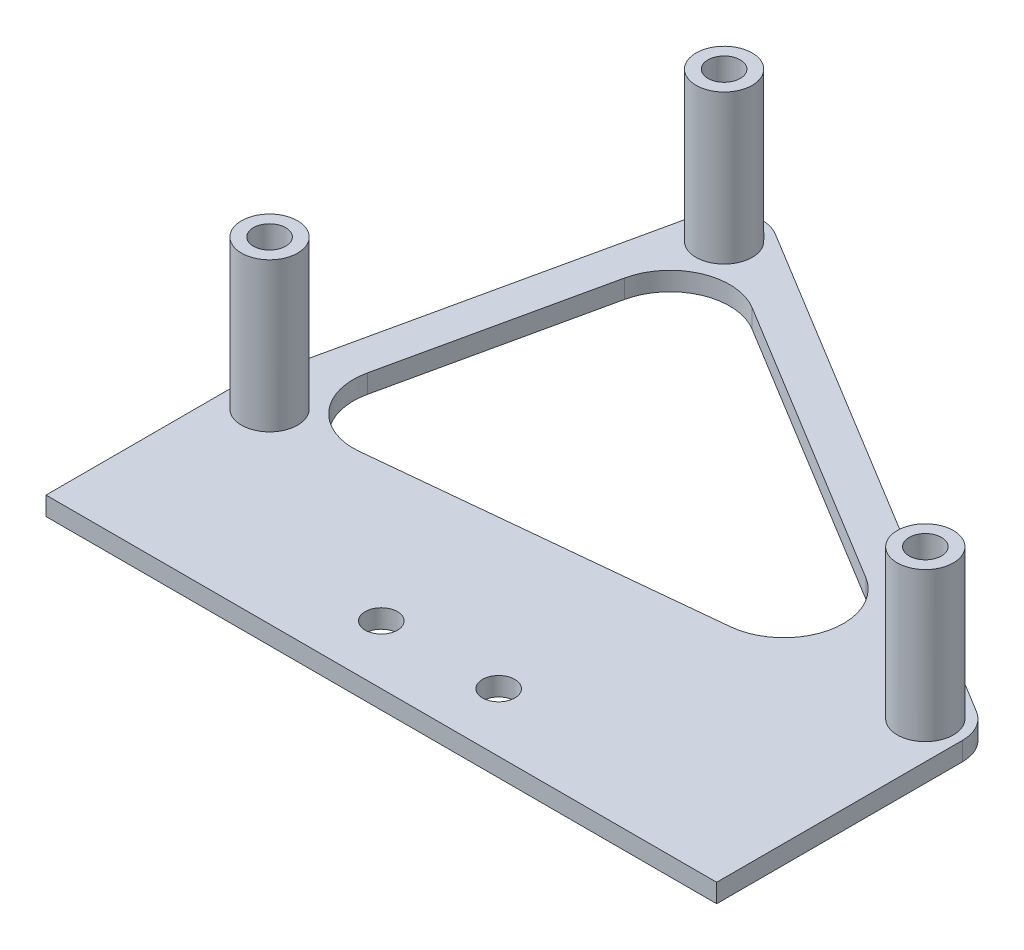
ISO-10303-21;
HEADER;
FILE_DESCRIPTION(('STEP AP214'),'2;1');
FILE_NAME('part.step','',(''),(''),'','','');
FILE_SCHEMA(('AUTOMOTIVE_DESIGN { 1 0 10303 214 1 1 1 1 }'));
ENDSEC;
DATA;
#1=APPLICATION_CONTEXT('core data for automotive mechanical design processes');
#2=APPLICATION_PROTOCOL_DEFINITION('international standard','automotive_design',2000,#1);
#3=PRODUCT_CONTEXT('',#1,'mechanical');
#4=PRODUCT('Part','Part','',(#3));
#5=PRODUCT_RELATED_PRODUCT_CATEGORY('part','',(#4));
#6=PRODUCT_DEFINITION_FORMATION('','',#4);
#7=PRODUCT_DEFINITION_CONTEXT('part definition',#1,'design');
#8=PRODUCT_DEFINITION('design','',#6,#7);
#9=PRODUCT_DEFINITION_SHAPE('','',#8);
#10=(LENGTH_UNIT() NAMED_UNIT(*) SI_UNIT(.MILLI.,.METRE.));
#11=(NAMED_UNIT(*) PLANE_ANGLE_UNIT() SI_UNIT($,.RADIAN.));
#12=(NAMED_UNIT(*) SI_UNIT($,.STERADIAN.) SOLID_ANGLE_UNIT());
#13=UNCERTAINTY_MEASURE_WITH_UNIT(LENGTH_MEASURE(1.E-05),#10,'distance_accuracy_value','');
#14=(GEOMETRIC_REPRESENTATION_CONTEXT(3) GLOBAL_UNCERTAINTY_ASSIGNED_CONTEXT((#13)) GLOBAL_UNIT_ASSIGNED_CONTEXT((#10,
#11,#12)) REPRESENTATION_CONTEXT('',''));
#15=CARTESIAN_POINT('',(0.,0.,0.));
#16=DIRECTION('',(0.,0.,1.));
#17=DIRECTION('',(1.,0.,0.));
#18=AXIS2_PLACEMENT_3D('',#15,#16,#17);
#19=CARTESIAN_POINT('',(-40.3225,0.,-42.545));
#20=DIRECTION('',(0.,-1.,0.));
#21=DIRECTION('',(0.,0.,-1.));
#22=AXIS2_PLACEMENT_3D('',#19,#20,#21);
#23=PLANE('',#22);
#24=CARTESIAN_POINT('',(-13.492499939,0.,42.705));
#25=DIRECTION('',(0.,1.,0.));
#26=DIRECTION('',(0.,0.,1.));
#27=AXIS2_PLACEMENT_3D('',#24,#25,#26);
#28=CIRCLE('',#27,2.749999961);
#29=CARTESIAN_POINT('',(-13.492499939,0.,45.454999961));
#30=VERTEX_POINT('',#29);
#31=EDGE_CURVE('E488',#30,#30,#28,.T.);
#32=ORIENTED_EDGE('',*,*,#31,.F.);
#33=EDGE_LOOP('',(#32));
#34=FACE_BOUND('',#33,.T.);
#35=CARTESIAN_POINT('',(6.50749993900001,0.,42.705));
#36=DIRECTION('',(0.,1.,0.));
#37=DIRECTION('',(0.,0.,1.));
#38=AXIS2_PLACEMENT_3D('',#35,#36,#37);
#39=CIRCLE('',#38,2.749999961);
#40=CARTESIAN_POINT('',(6.50749993900001,0.,45.454999961));
#41=VERTEX_POINT('',#40);
#42=EDGE_CURVE('E494',#41,#41,#39,.T.);
#43=ORIENTED_EDGE('',*,*,#42,.F.);
#44=EDGE_LOOP('',(#43));
#45=FACE_BOUND('',#44,.T.);
#46=CARTESIAN_POINT('',(-54.2925,0.,20.955));
#47=DIRECTION('',(0.,-1.,0.));
#48=DIRECTION('',(0.,0.,-1.));
#49=AXIS2_PLACEMENT_3D('',#46,#47,#48);
#50=CIRCLE('',#49,4.78199999999999);
#51=CARTESIAN_POINT('',(-54.2925,0.,16.173));
#52=VERTEX_POINT('',#51);
#53=EDGE_CURVE('E60',#52,#52,#50,.F.);
#54=ORIENTED_EDGE('',*,*,#53,.F.);
#55=EDGE_LOOP('',(#54));
#56=FACE_BOUND('',#55,.T.);
#57=DIRECTION('',(-0.854198555614438,0.,-0.519946946895745));
#58=VECTOR('',#57,1.);
#59=CARTESIAN_POINT('',(-40.3225,0.,-42.545));
#60=LINE('',#59,#58);
#61=CARTESIAN_POINT('',(21.399248973296,0.,-4.97523975538504));
#62=VERTEX_POINT('',#61);
#63=CARTESIAN_POINT('',(-28.1731352082768,0.,-35.1497344746033));
#64=VERTEX_POINT('',#63);
#65=EDGE_CURVE('E189',#62,#64,#60,.T.);
#66=ORIENTED_EDGE('',*,*,#65,.F.);
#67=CARTESIAN_POINT('',(16.1165879928353,0.,3.70341756965765));
#68=DIRECTION('',(0.,-1.,0.));
#69=DIRECTION('',(0.,0.,-1.));
#70=AXIS2_PLACEMENT_3D('',#67,#68,#69);
#71=CIRCLE('',#70,10.16);
#72=CARTESIAN_POINT('',(17.1275457780886,0.,13.8129954221911));
#73=VERTEX_POINT('',#72);
#74=EDGE_CURVE('E255',#62,#73,#71,.T.);
#75=ORIENTED_EDGE('',*,*,#74,.T.);
#76=DIRECTION('',(0.995037190209989,0.,-0.0995037190209989));
#77=VECTOR('',#76,1.);
#78=CARTESIAN_POINT('',(47.3075,0.,10.795));
#79=LINE('',#78,#77);
#80=CARTESIAN_POINT('',(-40.3476822585176,0.,19.5605182258518));
#81=VERTEX_POINT('',#80);
#82=EDGE_CURVE('E193',#81,#73,#79,.T.);
#83=ORIENTED_EDGE('',*,*,#82,.F.);
#84=CARTESIAN_POINT('',(-41.3586400437709,0.,9.45094037331826));
#85=DIRECTION('',(0.,-1.,0.));
#86=DIRECTION('',(0.,0.,-1.));
#87=AXIS2_PLACEMENT_3D('',#84,#85,#86);
#88=CIRCLE('',#87,10.16);
#89=CARTESIAN_POINT('',(-51.2813478254946,0.,7.26794466133905));
#90=VERTEX_POINT('',#89);
#91=EDGE_CURVE('E259',#81,#90,#88,.T.);
#92=ORIENTED_EDGE('',*,*,#91,.T.);
#93=DIRECTION('',(-0.21486178267512,0.,0.97664446670509));
#94=VECTOR('',#93,1.);
#95=CARTESIAN_POINT('',(-54.2925,0.,20.955));
#96=LINE('',#95,#94);
#97=CARTESIAN_POINT('',(-43.3785039704613,0.,-28.6540728615398));
#98=VERTEX_POINT('',#97);
#99=EDGE_CURVE('E188',#98,#90,#96,.T.);
#100=ORIENTED_EDGE('',*,*,#99,.F.);
#101=CARTESIAN_POINT('',(-33.4557961887375,0.,-26.4710771495606));
#102=DIRECTION('',(0.,-1.,0.));
#103=DIRECTION('',(0.,0.,-1.));
#104=AXIS2_PLACEMENT_3D('',#101,#102,#103);
#105=CIRCLE('',#104,10.16);
#106=EDGE_CURVE('E263',#98,#64,#105,.T.);
#107=ORIENTED_EDGE('',*,*,#106,.T.);
#108=EDGE_LOOP('',(#66,#75,#83,#92,#100,#107));
#109=FACE_BOUND('',#108,.T.);
#110=DIRECTION('',(0.,0.,-1.));
#111=VECTOR('',#110,1.);
#112=CARTESIAN_POINT('',(53.6575,0.,52.705));
#113=LINE('',#112,#111);
#114=CARTESIAN_POINT('',(53.6575,0.,52.705));
#115=VERTEX_POINT('',#114);
#116=CARTESIAN_POINT('',(53.6575,0.,10.795));
#117=VERTEX_POINT('',#116);
#118=EDGE_CURVE('E176',#115,#117,#113,.T.);
#119=ORIENTED_EDGE('',*,*,#118,.T.);
#120=CARTESIAN_POINT('',(47.3075,0.,10.795));
#121=DIRECTION('',(0.,1.,0.));
#122=DIRECTION('',(0.,0.,-1.));
#123=AXIS2_PLACEMENT_3D('',#120,#121,#122);
#124=CIRCLE('',#123,6.35);
#125=CARTESIAN_POINT('',(50.609163112788,0.,5.3708391718483));
#126=VERTEX_POINT('',#125);
#127=EDGE_CURVE('E72',#117,#126,#124,.T.);
#128=ORIENTED_EDGE('',*,*,#127,.T.);
#129=DIRECTION('',(-0.854198555614438,0.,-0.519946946895745));
#130=VECTOR('',#129,1.);
#131=CARTESIAN_POINT('',(-37.020836887212,0.,-47.9691608281517));
#132=LINE('',#131,#130);
#133=CARTESIAN_POINT('',(-37.020836887212,0.,-47.9691608281517));
#134=VERTEX_POINT('',#133);
#135=EDGE_CURVE('E211',#126,#134,#132,.T.);
#136=ORIENTED_EDGE('',*,*,#135,.T.);
#137=CARTESIAN_POINT('',(-40.3225,0.,-42.545));
#138=DIRECTION('',(0.,1.,0.));
#139=DIRECTION('',(0.,0.,-1.));
#140=AXIS2_PLACEMENT_3D('',#137,#138,#139);
#141=CIRCLE('',#140,6.35000000000001);
#142=CARTESIAN_POINT('',(-46.5241923635773,0.,-43.909372319987));
#143=VERTEX_POINT('',#142);
#144=EDGE_CURVE('E201',#134,#143,#141,.T.);
#145=ORIENTED_EDGE('',*,*,#144,.T.);
#146=DIRECTION('',(-0.21486178267512,0.,0.97664446670509));
#147=VECTOR('',#146,1.);
#148=CARTESIAN_POINT('',(-60.4941923635773,0.,19.590627680013));
#149=LINE('',#148,#147);
#150=CARTESIAN_POINT('',(-60.4941923635773,0.,19.590627680013));
#151=VERTEX_POINT('',#150);
#152=EDGE_CURVE('E224',#143,#151,#149,.T.);
#153=ORIENTED_EDGE('',*,*,#152,.T.);
#154=CARTESIAN_POINT('',(-54.2925,0.,20.955));
#155=DIRECTION('',(0.,1.,0.));
#156=DIRECTION('',(0.,0.,-1.));
#157=AXIS2_PLACEMENT_3D('',#154,#155,#156);
#158=CIRCLE('',#157,6.35);
#159=CARTESIAN_POINT('',(-60.6425,0.,20.955));
#160=VERTEX_POINT('',#159);
#161=EDGE_CURVE('E227',#151,#160,#158,.T.);
#162=ORIENTED_EDGE('',*,*,#161,.T.);
#163=DIRECTION('',(0.,0.,1.));
#164=VECTOR('',#163,1.);
#165=CARTESIAN_POINT('',(-60.6425,0.,20.955));
#166=LINE('',#165,#164);
#167=CARTESIAN_POINT('',(-60.6425,0.,52.705));
#168=VERTEX_POINT('',#167);
#169=EDGE_CURVE('E182',#160,#168,#166,.T.);
#170=ORIENTED_EDGE('',*,*,#169,.T.);
#171=DIRECTION('',(1.,0.,0.));
#172=VECTOR('',#171,1.);
#173=CARTESIAN_POINT('',(-60.6425,0.,52.705));
#174=LINE('',#173,#172);
#175=EDGE_CURVE('E169',#168,#115,#174,.T.);
#176=ORIENTED_EDGE('',*,*,#175,.T.);
#177=EDGE_LOOP('',(#119,#128,#136,#145,#153,#162,#170,#176));
#178=FACE_BOUND('',#177,.T.);
#179=CARTESIAN_POINT('',(47.3075,0.,10.795));
#180=DIRECTION('',(0.,-1.,0.));
#181=DIRECTION('',(0.,0.,-1.));
#182=AXIS2_PLACEMENT_3D('',#179,#180,#181);
#183=CIRCLE('',#182,4.78200000000001);
#184=CARTESIAN_POINT('',(47.3075,0.,6.01299999999998));
#185=VERTEX_POINT('',#184);
#186=EDGE_CURVE('E267',#185,#185,#183,.F.);
#187=ORIENTED_EDGE('',*,*,#186,.F.);
#188=EDGE_LOOP('',(#187));
#189=FACE_BOUND('',#188,.T.);
#190=CARTESIAN_POINT('',(-40.3225,0.,-42.545));
#191=DIRECTION('',(0.,-1.,0.));
#192=DIRECTION('',(0.,0.,-1.));
#193=AXIS2_PLACEMENT_3D('',#190,#191,#192);
#194=CIRCLE('',#193,4.782);
#195=CARTESIAN_POINT('',(-40.3225,0.,-47.327));
#196=VERTEX_POINT('',#195);
#197=EDGE_CURVE('E12',#196,#196,#194,.F.);
#198=ORIENTED_EDGE('',*,*,#197,.F.);
#199=EDGE_LOOP('',(#198));
#200=FACE_BOUND('',#199,.T.);
#201=ADVANCED_FACE('F52',(#34,#45,#56,#109,#178,#189,#200),#23,.F.);
#202=CARTESIAN_POINT('',(47.3075,-3.175,10.795));
#203=DIRECTION('',(0.,1.,0.));
#204=DIRECTION('',(0.,0.,1.));
#205=AXIS2_PLACEMENT_3D('',#202,#203,#204);
#206=CYLINDRICAL_SURFACE('',#205,6.35);
#207=ORIENTED_EDGE('',*,*,#127,.F.);
#208=DIRECTION('',(0.,1.,0.));
#209=VECTOR('',#208,1.);
#210=CARTESIAN_POINT('',(53.6575,-124.916275252069,10.795));
#211=LINE('',#210,#209);
#212=CARTESIAN_POINT('',(53.6575,-3.175,10.795));
#213=VERTEX_POINT('',#212);
#214=EDGE_CURVE('E67',#213,#117,#211,.T.);
#215=ORIENTED_EDGE('',*,*,#214,.F.);
#216=CARTESIAN_POINT('',(47.3075,-3.175,10.795));
#217=DIRECTION('',(0.,1.,0.));
#218=DIRECTION('',(0.,0.,-1.));
#219=AXIS2_PLACEMENT_3D('',#216,#217,#218);
#220=CIRCLE('',#219,6.35);
#221=CARTESIAN_POINT('',(50.609163112788,-3.175,5.3708391718483));
#222=VERTEX_POINT('',#221);
#223=EDGE_CURVE('E216',#213,#222,#220,.T.);
#224=ORIENTED_EDGE('',*,*,#223,.T.);
#225=DIRECTION('',(0.,1.,0.));
#226=VECTOR('',#225,1.);
#227=CARTESIAN_POINT('',(50.609163112788,-3.175,5.3708391718483));
#228=LINE('',#227,#226);
#229=EDGE_CURVE('E236',#222,#126,#228,.T.);
#230=ORIENTED_EDGE('',*,*,#229,.T.);
#231=EDGE_LOOP('',(#207,#215,#224,#230));
#232=FACE_BOUND('',#231,.T.);
#233=ADVANCED_FACE('F276',(#232),#206,.T.);
#234=CARTESIAN_POINT('',(-40.3225,-3.175,-42.545));
#235=DIRECTION('',(0.,-1.,0.));
#236=DIRECTION('',(0.,0.,-1.));
#237=AXIS2_PLACEMENT_3D('',#234,#235,#236);
#238=PLANE('',#237);
#239=CARTESIAN_POINT('',(-13.492499939,-3.175,42.705));
#240=DIRECTION('',(0.,1.,0.));
#241=DIRECTION('',(0.,0.,1.));
#242=AXIS2_PLACEMENT_3D('',#239,#240,#241);
#243=CIRCLE('',#242,2.749999961);
#244=CARTESIAN_POINT('',(-13.492499939,-3.175,45.454999961));
#245=VERTEX_POINT('',#244);
#246=EDGE_CURVE('E485',#245,#245,#243,.T.);
#247=ORIENTED_EDGE('',*,*,#246,.T.);
#248=EDGE_LOOP('',(#247));
#249=FACE_BOUND('',#248,.T.);
#250=CARTESIAN_POINT('',(6.50749993900001,-3.175,42.705));
#251=DIRECTION('',(0.,1.,0.));
#252=DIRECTION('',(0.,0.,1.));
#253=AXIS2_PLACEMENT_3D('',#250,#251,#252);
#254=CIRCLE('',#253,2.749999961);
#255=CARTESIAN_POINT('',(6.50749993900001,-3.175,45.454999961));
#256=VERTEX_POINT('',#255);
#257=EDGE_CURVE('E489',#256,#256,#254,.T.);
#258=ORIENTED_EDGE('',*,*,#257,.T.);
#259=EDGE_LOOP('',(#258));
#260=FACE_BOUND('',#259,.T.);
#261=CARTESIAN_POINT('',(-54.2925,-3.175,20.955));
#262=DIRECTION('',(0.,1.,0.));
#263=DIRECTION('',(0.,0.,1.));
#264=AXIS2_PLACEMENT_3D('',#261,#262,#263);
#265=CIRCLE('',#264,2.74999999999999);
#266=CARTESIAN_POINT('',(-54.2925,-3.175,23.705));
#267=VERTEX_POINT('',#266);
#268=EDGE_CURVE('E517',#267,#267,#265,.T.);
#269=ORIENTED_EDGE('',*,*,#268,.T.);
#270=EDGE_LOOP('',(#269));
#271=FACE_BOUND('',#270,.T.);
#272=CARTESIAN_POINT('',(47.3075,-3.175,10.795));
#273=DIRECTION('',(0.,1.,0.));
#274=DIRECTION('',(0.,0.,1.));
#275=AXIS2_PLACEMENT_3D('',#272,#273,#274);
#276=CIRCLE('',#275,2.75000000000001);
#277=CARTESIAN_POINT('',(47.3075,-3.175,13.545));
#278=VERTEX_POINT('',#277);
#279=EDGE_CURVE('E520',#278,#278,#276,.T.);
#280=ORIENTED_EDGE('',*,*,#279,.T.);
#281=EDGE_LOOP('',(#280));
#282=FACE_BOUND('',#281,.T.);
#283=CARTESIAN_POINT('',(-40.3225,-3.175,-42.545));
#284=DIRECTION('',(0.,1.,0.));
#285=DIRECTION('',(0.,0.,1.));
#286=AXIS2_PLACEMENT_3D('',#283,#284,#285);
#287=CIRCLE('',#286,2.75);
#288=CARTESIAN_POINT('',(-40.3225,-3.175,-39.795));
#289=VERTEX_POINT('',#288);
#290=EDGE_CURVE('E516',#289,#289,#287,.T.);
#291=ORIENTED_EDGE('',*,*,#290,.T.);
#292=EDGE_LOOP('',(#291));
#293=FACE_BOUND('',#292,.T.);
#294=ORIENTED_EDGE('',*,*,#223,.F.);
#295=DIRECTION('',(0.,0.,-1.));
#296=VECTOR('',#295,1.);
#297=CARTESIAN_POINT('',(53.6575,-3.175,52.705));
#298=LINE('',#297,#296);
#299=CARTESIAN_POINT('',(53.6575,-3.175,52.705));
#300=VERTEX_POINT('',#299);
#301=EDGE_CURVE('E160',#300,#213,#298,.T.);
#302=ORIENTED_EDGE('',*,*,#301,.F.);
#303=DIRECTION('',(1.,0.,0.));
#304=VECTOR('',#303,1.);
#305=CARTESIAN_POINT('',(-60.6425,-3.175,52.705));
#306=LINE('',#305,#304);
#307=CARTESIAN_POINT('',(-60.6425,-3.175,52.705));
#308=VERTEX_POINT('',#307);
#309=EDGE_CURVE('E151',#308,#300,#306,.T.);
#310=ORIENTED_EDGE('',*,*,#309,.F.);
#311=DIRECTION('',(0.,0.,1.));
#312=VECTOR('',#311,1.);
#313=CARTESIAN_POINT('',(-60.6425,-3.175,20.955));
#314=LINE('',#313,#312);
#315=CARTESIAN_POINT('',(-60.6425,-3.175,20.955));
#316=VERTEX_POINT('',#315);
#317=EDGE_CURVE('E157',#316,#308,#314,.T.);
#318=ORIENTED_EDGE('',*,*,#317,.F.);
#319=CARTESIAN_POINT('',(-54.2925,-3.175,20.955));
#320=DIRECTION('',(0.,1.,0.));
#321=DIRECTION('',(0.,0.,-1.));
#322=AXIS2_PLACEMENT_3D('',#319,#320,#321);
#323=CIRCLE('',#322,6.35);
#324=CARTESIAN_POINT('',(-60.4941923635773,-3.175,19.590627680013));
#325=VERTEX_POINT('',#324);
#326=EDGE_CURVE('E214',#325,#316,#323,.T.);
#327=ORIENTED_EDGE('',*,*,#326,.F.);
#328=DIRECTION('',(-0.21486178267512,0.,0.97664446670509));
#329=VECTOR('',#328,1.);
#330=CARTESIAN_POINT('',(-60.4941923635773,-3.175,19.590627680013));
#331=LINE('',#330,#329);
#332=CARTESIAN_POINT('',(-46.5241923635773,-3.175,-43.909372319987));
#333=VERTEX_POINT('',#332);
#334=EDGE_CURVE('E210',#333,#325,#331,.T.);
#335=ORIENTED_EDGE('',*,*,#334,.F.);
#336=CARTESIAN_POINT('',(-40.3225,-3.175,-42.545));
#337=DIRECTION('',(0.,1.,0.));
#338=DIRECTION('',(0.,0.,-1.));
#339=AXIS2_PLACEMENT_3D('',#336,#337,#338);
#340=CIRCLE('',#339,6.35000000000001);
#341=CARTESIAN_POINT('',(-37.020836887212,-3.175,-47.9691608281517));
#342=VERTEX_POINT('',#341);
#343=EDGE_CURVE('E207',#342,#333,#340,.T.);
#344=ORIENTED_EDGE('',*,*,#343,.F.);
#345=DIRECTION('',(-0.854198555614438,0.,-0.519946946895745));
#346=VECTOR('',#345,1.);
#347=CARTESIAN_POINT('',(-37.020836887212,-3.175,-47.9691608281517));
#348=LINE('',#347,#346);
#349=EDGE_CURVE('E218',#222,#342,#348,.T.);
#350=ORIENTED_EDGE('',*,*,#349,.F.);
#351=EDGE_LOOP('',(#294,#302,#310,#318,#327,#335,#344,#350));
#352=FACE_BOUND('',#351,.T.);
#353=DIRECTION('',(0.995037190209989,0.,-0.0995037190209989));
#354=VECTOR('',#353,1.);
#355=CARTESIAN_POINT('',(47.3075,-3.175,10.795));
#356=LINE('',#355,#354);
#357=CARTESIAN_POINT('',(-40.3476822585176,-3.175,19.5605182258518));
#358=VERTEX_POINT('',#357);
#359=CARTESIAN_POINT('',(17.1275457780886,-3.175,13.8129954221911));
#360=VERTEX_POINT('',#359);
#361=EDGE_CURVE('E202',#358,#360,#356,.T.);
#362=ORIENTED_EDGE('',*,*,#361,.T.);
#363=CARTESIAN_POINT('',(16.1165879928353,-3.175,3.70341756965765));
#364=DIRECTION('',(0.,-1.,0.));
#365=DIRECTION('',(0.,0.,-1.));
#366=AXIS2_PLACEMENT_3D('',#363,#364,#365);
#367=CIRCLE('',#366,10.16);
#368=CARTESIAN_POINT('',(21.399248973296,-3.175,-4.97523975538504));
#369=VERTEX_POINT('',#368);
#370=EDGE_CURVE('E257',#360,#369,#367,.F.);
#371=ORIENTED_EDGE('',*,*,#370,.T.);
#372=DIRECTION('',(-0.854198555614438,0.,-0.519946946895745));
#373=VECTOR('',#372,1.);
#374=CARTESIAN_POINT('',(-40.3225,-3.175,-42.545));
#375=LINE('',#374,#373);
#376=CARTESIAN_POINT('',(-28.1731352082768,-3.175,-35.1497344746033));
#377=VERTEX_POINT('',#376);
#378=EDGE_CURVE('E198',#369,#377,#375,.T.);
#379=ORIENTED_EDGE('',*,*,#378,.T.);
#380=CARTESIAN_POINT('',(-33.4557961887375,-3.175,-26.4710771495606));
#381=DIRECTION('',(0.,-1.,0.));
#382=DIRECTION('',(0.,0.,-1.));
#383=AXIS2_PLACEMENT_3D('',#380,#381,#382);
#384=CIRCLE('',#383,10.16);
#385=CARTESIAN_POINT('',(-43.3785039704613,-3.175,-28.6540728615398));
#386=VERTEX_POINT('',#385);
#387=EDGE_CURVE('E265',#377,#386,#384,.F.);
#388=ORIENTED_EDGE('',*,*,#387,.T.);
#389=DIRECTION('',(-0.21486178267512,0.,0.97664446670509));
#390=VECTOR('',#389,1.);
#391=CARTESIAN_POINT('',(-54.2925,-3.175,20.955));
#392=LINE('',#391,#390);
#393=CARTESIAN_POINT('',(-51.2813478254946,-3.175,7.26794466133905));
#394=VERTEX_POINT('',#393);
#395=EDGE_CURVE('E192',#386,#394,#392,.T.);
#396=ORIENTED_EDGE('',*,*,#395,.T.);
#397=CARTESIAN_POINT('',(-41.3586400437709,-3.175,9.45094037331826));
#398=DIRECTION('',(0.,-1.,0.));
#399=DIRECTION('',(0.,0.,-1.));
#400=AXIS2_PLACEMENT_3D('',#397,#398,#399);
#401=CIRCLE('',#400,10.16);
#402=EDGE_CURVE('E261',#394,#358,#401,.F.);
#403=ORIENTED_EDGE('',*,*,#402,.T.);
#404=EDGE_LOOP('',(#362,#371,#379,#388,#396,#403));
#405=FACE_BOUND('',#404,.T.);
#406=ADVANCED_FACE('F153',(#249,#260,#271,#282,#293,#352,#405),#238,.T.);
#407=CARTESIAN_POINT('',(-40.3225,-3.175,-42.545));
#408=DIRECTION('',(0.,1.,0.));
#409=DIRECTION('',(0.,0.,1.));
#410=AXIS2_PLACEMENT_3D('',#407,#408,#409);
#411=CYLINDRICAL_SURFACE('',#410,6.35000000000001);
#412=ORIENTED_EDGE('',*,*,#144,.F.);
#413=DIRECTION('',(0.,1.,0.));
#414=VECTOR('',#413,1.);
#415=CARTESIAN_POINT('',(-37.020836887212,-3.175,-47.9691608281517));
#416=LINE('',#415,#414);
#417=EDGE_CURVE('E233',#342,#134,#416,.T.);
#418=ORIENTED_EDGE('',*,*,#417,.F.);
#419=ORIENTED_EDGE('',*,*,#343,.T.);
#420=DIRECTION('',(0.,1.,0.));
#421=VECTOR('',#420,1.);
#422=CARTESIAN_POINT('',(-46.5241923635773,-3.175,-43.909372319987));
#423=LINE('',#422,#421);
#424=EDGE_CURVE('E221',#333,#143,#423,.T.);
#425=ORIENTED_EDGE('',*,*,#424,.T.);
#426=EDGE_LOOP('',(#412,#418,#419,#425));
#427=FACE_BOUND('',#426,.T.);
#428=ADVANCED_FACE('F354',(#427),#411,.T.);
#429=CARTESIAN_POINT('',(-37.020836887212,-3.175,-47.9691608281517));
#430=DIRECTION('',(0.519946946895745,0.,-0.854198555614438));
#431=DIRECTION('',(-0.854198555614438,0.,-0.519946946895745));
#432=AXIS2_PLACEMENT_3D('',#429,#430,#431);
#433=PLANE('',#432);
#434=ORIENTED_EDGE('',*,*,#135,.F.);
#435=ORIENTED_EDGE('',*,*,#229,.F.);
#436=ORIENTED_EDGE('',*,*,#349,.T.);
#437=ORIENTED_EDGE('',*,*,#417,.T.);
#438=EDGE_LOOP('',(#434,#435,#436,#437));
#439=FACE_BOUND('',#438,.T.);
#440=ADVANCED_FACE('F357',(#439),#433,.T.);
#441=CARTESIAN_POINT('',(-54.2925,-3.175,20.955));
#442=DIRECTION('',(0.,1.,0.));
#443=DIRECTION('',(0.,0.,1.));
#444=AXIS2_PLACEMENT_3D('',#441,#442,#443);
#445=CYLINDRICAL_SURFACE('',#444,6.35);
#446=DIRECTION('',(0.,1.,0.));
#447=VECTOR('',#446,1.);
#448=CARTESIAN_POINT('',(-60.6425,-124.916275252069,20.955));
#449=LINE('',#448,#447);
#450=EDGE_CURVE('E175',#316,#160,#449,.T.);
#451=ORIENTED_EDGE('',*,*,#450,.T.);
#452=ORIENTED_EDGE('',*,*,#161,.F.);
#453=DIRECTION('',(0.,1.,0.));
#454=VECTOR('',#453,1.);
#455=CARTESIAN_POINT('',(-60.4941923635773,-3.175,19.590627680013));
#456=LINE('',#455,#454);
#457=EDGE_CURVE('E238',#325,#151,#456,.T.);
#458=ORIENTED_EDGE('',*,*,#457,.F.);
#459=ORIENTED_EDGE('',*,*,#326,.T.);
#460=EDGE_LOOP('',(#451,#452,#458,#459));
#461=FACE_BOUND('',#460,.T.);
#462=ADVANCED_FACE('F360',(#461),#445,.T.);
#463=CARTESIAN_POINT('',(-60.4941923635773,-3.175,19.590627680013));
#464=DIRECTION('',(-0.97664446670509,0.,-0.21486178267512));
#465=DIRECTION('',(-0.21486178267512,0.,0.97664446670509));
#466=AXIS2_PLACEMENT_3D('',#463,#464,#465);
#467=PLANE('',#466);
#468=ORIENTED_EDGE('',*,*,#152,.F.);
#469=ORIENTED_EDGE('',*,*,#424,.F.);
#470=ORIENTED_EDGE('',*,*,#334,.T.);
#471=ORIENTED_EDGE('',*,*,#457,.T.);
#472=EDGE_LOOP('',(#468,#469,#470,#471));
#473=FACE_BOUND('',#472,.T.);
#474=ADVANCED_FACE('F343',(#473),#467,.T.);
#475=CARTESIAN_POINT('',(-40.3225,-3.175,-42.545));
#476=DIRECTION('',(0.519946946895745,0.,-0.854198555614438));
#477=DIRECTION('',(-0.854198555614438,0.,-0.519946946895745));
#478=AXIS2_PLACEMENT_3D('',#475,#476,#477);
#479=PLANE('',#478);
#480=ORIENTED_EDGE('',*,*,#378,.F.);
#481=DIRECTION('',(0.,1.,0.));
#482=VECTOR('',#481,1.);
#483=CARTESIAN_POINT('',(21.399248973296,0.,-4.97523975538504));
#484=LINE('',#483,#482);
#485=EDGE_CURVE('E242',#369,#62,#484,.T.);
#486=ORIENTED_EDGE('',*,*,#485,.T.);
#487=ORIENTED_EDGE('',*,*,#65,.T.);
#488=DIRECTION('',(0.,1.,0.));
#489=VECTOR('',#488,1.);
#490=CARTESIAN_POINT('',(-28.1731352082768,-3.175,-35.1497344746033));
#491=LINE('',#490,#489);
#492=EDGE_CURVE('E235',#64,#377,#491,.F.);
#493=ORIENTED_EDGE('',*,*,#492,.T.);
#494=EDGE_LOOP('',(#480,#486,#487,#493));
#495=FACE_BOUND('',#494,.T.);
#496=ADVANCED_FACE('F339',(#495),#479,.F.);
#497=CARTESIAN_POINT('',(47.3075,-3.175,10.795));
#498=DIRECTION('',(0.0995037190209989,0.,0.995037190209989));
#499=DIRECTION('',(0.995037190209989,0.,-0.0995037190209989));
#500=AXIS2_PLACEMENT_3D('',#497,#498,#499);
#501=PLANE('',#500);
#502=ORIENTED_EDGE('',*,*,#82,.T.);
#503=DIRECTION('',(0.,1.,0.));
#504=VECTOR('',#503,1.);
#505=CARTESIAN_POINT('',(17.1275457780886,-3.175,13.8129954221911));
#506=LINE('',#505,#504);
#507=EDGE_CURVE('E248',#73,#360,#506,.F.);
#508=ORIENTED_EDGE('',*,*,#507,.T.);
#509=ORIENTED_EDGE('',*,*,#361,.F.);
#510=DIRECTION('',(0.,1.,0.));
#511=VECTOR('',#510,1.);
#512=CARTESIAN_POINT('',(-40.3476822585175,0.,19.5605182258518));
#513=LINE('',#512,#511);
#514=EDGE_CURVE('E245',#358,#81,#513,.T.);
#515=ORIENTED_EDGE('',*,*,#514,.T.);
#516=EDGE_LOOP('',(#502,#508,#509,#515));
#517=FACE_BOUND('',#516,.T.);
#518=ADVANCED_FACE('F342',(#517),#501,.F.);
#519=CARTESIAN_POINT('',(-54.2925,-3.175,20.955));
#520=DIRECTION('',(-0.97664446670509,0.,-0.21486178267512));
#521=DIRECTION('',(-0.21486178267512,0.,0.97664446670509));
#522=AXIS2_PLACEMENT_3D('',#519,#520,#521);
#523=PLANE('',#522);
#524=ORIENTED_EDGE('',*,*,#99,.T.);
#525=DIRECTION('',(0.,1.,0.));
#526=VECTOR('',#525,1.);
#527=CARTESIAN_POINT('',(-51.2813478254946,-3.175,7.26794466133905));
#528=LINE('',#527,#526);
#529=EDGE_CURVE('E253',#90,#394,#528,.F.);
#530=ORIENTED_EDGE('',*,*,#529,.T.);
#531=ORIENTED_EDGE('',*,*,#395,.F.);
#532=DIRECTION('',(0.,1.,0.));
#533=VECTOR('',#532,1.);
#534=CARTESIAN_POINT('',(-43.3785039704613,0.,-28.6540728615398));
#535=LINE('',#534,#533);
#536=EDGE_CURVE('E250',#386,#98,#535,.T.);
#537=ORIENTED_EDGE('',*,*,#536,.T.);
#538=EDGE_LOOP('',(#524,#530,#531,#537));
#539=FACE_BOUND('',#538,.T.);
#540=ADVANCED_FACE('F347',(#539),#523,.F.);
#541=CARTESIAN_POINT('',(16.1165879928353,-3.175,3.70341756965765));
#542=DIRECTION('',(0.,-1.,0.));
#543=DIRECTION('',(0.,0.,-1.));
#544=AXIS2_PLACEMENT_3D('',#541,#542,#543);
#545=CYLINDRICAL_SURFACE('',#544,10.16);
#546=ORIENTED_EDGE('',*,*,#370,.F.);
#547=ORIENTED_EDGE('',*,*,#507,.F.);
#548=ORIENTED_EDGE('',*,*,#74,.F.);
#549=ORIENTED_EDGE('',*,*,#485,.F.);
#550=EDGE_LOOP('',(#546,#547,#548,#549));
#551=FACE_BOUND('',#550,.T.);
#552=ADVANCED_FACE('F351',(#551),#545,.F.);
#553=CARTESIAN_POINT('',(-41.3586400437709,-3.175,9.45094037331826));
#554=DIRECTION('',(0.,-1.,0.));
#555=DIRECTION('',(0.,0.,-1.));
#556=AXIS2_PLACEMENT_3D('',#553,#554,#555);
#557=CYLINDRICAL_SURFACE('',#556,10.16);
#558=ORIENTED_EDGE('',*,*,#402,.F.);
#559=ORIENTED_EDGE('',*,*,#529,.F.);
#560=ORIENTED_EDGE('',*,*,#91,.F.);
#561=ORIENTED_EDGE('',*,*,#514,.F.);
#562=EDGE_LOOP('',(#558,#559,#560,#561));
#563=FACE_BOUND('',#562,.T.);
#564=ADVANCED_FACE('F374',(#563),#557,.F.);
#565=CARTESIAN_POINT('',(-33.4557961887375,-3.175,-26.4710771495606));
#566=DIRECTION('',(0.,-1.,0.));
#567=DIRECTION('',(0.,0.,-1.));
#568=AXIS2_PLACEMENT_3D('',#565,#566,#567);
#569=CYLINDRICAL_SURFACE('',#568,10.16);
#570=ORIENTED_EDGE('',*,*,#387,.F.);
#571=ORIENTED_EDGE('',*,*,#492,.F.);
#572=ORIENTED_EDGE('',*,*,#106,.F.);
#573=ORIENTED_EDGE('',*,*,#536,.F.);
#574=EDGE_LOOP('',(#570,#571,#572,#573));
#575=FACE_BOUND('',#574,.T.);
#576=ADVANCED_FACE('F54',(#575),#569,.F.);
#577=CARTESIAN_POINT('',(-60.6425,-124.916275252069,20.955));
#578=DIRECTION('',(-1.,0.,0.));
#579=DIRECTION('',(0.,0.,1.));
#580=AXIS2_PLACEMENT_3D('',#577,#578,#579);
#581=PLANE('',#580);
#582=ORIENTED_EDGE('',*,*,#450,.F.);
#583=ORIENTED_EDGE('',*,*,#317,.T.);
#584=DIRECTION('',(0.,1.,0.));
#585=VECTOR('',#584,1.);
#586=CARTESIAN_POINT('',(-60.6425,-124.916275252069,52.705));
#587=LINE('',#586,#585);
#588=EDGE_CURVE('E164',#308,#168,#587,.T.);
#589=ORIENTED_EDGE('',*,*,#588,.T.);
#590=ORIENTED_EDGE('',*,*,#169,.F.);
#591=EDGE_LOOP('',(#582,#583,#589,#590));
#592=FACE_BOUND('',#591,.T.);
#593=ADVANCED_FACE('F174',(#592),#581,.T.);
#594=CARTESIAN_POINT('',(-60.6425,-124.916275252069,52.705));
#595=DIRECTION('',(0.,0.,1.));
#596=DIRECTION('',(1.,0.,0.));
#597=AXIS2_PLACEMENT_3D('',#594,#595,#596);
#598=PLANE('',#597);
#599=ORIENTED_EDGE('',*,*,#588,.F.);
#600=ORIENTED_EDGE('',*,*,#309,.T.);
#601=DIRECTION('',(0.,1.,0.));
#602=VECTOR('',#601,1.);
#603=CARTESIAN_POINT('',(53.6575,-124.916275252069,52.705));
#604=LINE('',#603,#602);
#605=EDGE_CURVE('E163',#300,#115,#604,.T.);
#606=ORIENTED_EDGE('',*,*,#605,.T.);
#607=ORIENTED_EDGE('',*,*,#175,.F.);
#608=EDGE_LOOP('',(#599,#600,#606,#607));
#609=FACE_BOUND('',#608,.T.);
#610=ADVANCED_FACE('F167',(#609),#598,.T.);
#611=CARTESIAN_POINT('',(53.6575,-124.916275252069,52.705));
#612=DIRECTION('',(1.,0.,0.));
#613=DIRECTION('',(0.,0.,-1.));
#614=AXIS2_PLACEMENT_3D('',#611,#612,#613);
#615=PLANE('',#614);
#616=ORIENTED_EDGE('',*,*,#605,.F.);
#617=ORIENTED_EDGE('',*,*,#301,.T.);
#618=ORIENTED_EDGE('',*,*,#214,.T.);
#619=ORIENTED_EDGE('',*,*,#118,.F.);
#620=EDGE_LOOP('',(#616,#617,#618,#619));
#621=FACE_BOUND('',#620,.T.);
#622=ADVANCED_FACE('F330',(#621),#615,.T.);
#623=CARTESIAN_POINT('',(-40.3225,-3.175,-42.545));
#624=DIRECTION('',(0.,1.,0.));
#625=DIRECTION('',(0.,0.,1.));
#626=AXIS2_PLACEMENT_3D('',#623,#624,#625);
#627=CYLINDRICAL_SURFACE('',#626,2.75);
#628=ORIENTED_EDGE('',*,*,#290,.F.);
#629=EDGE_LOOP('',(#628));
#630=FACE_BOUND('',#629,.T.);
#631=CARTESIAN_POINT('',(-40.3225,25.4,-42.545));
#632=DIRECTION('',(0.,1.,0.));
#633=DIRECTION('',(0.,0.,1.));
#634=AXIS2_PLACEMENT_3D('',#631,#632,#633);
#635=CIRCLE('',#634,2.75);
#636=CARTESIAN_POINT('',(-40.3225,25.4,-39.795));
#637=VERTEX_POINT('',#636);
#638=EDGE_CURVE('E491',#637,#637,#635,.T.);
#639=ORIENTED_EDGE('',*,*,#638,.T.);
#640=EDGE_LOOP('',(#639));
#641=FACE_BOUND('',#640,.T.);
#642=ADVANCED_FACE('F326',(#630,#641),#627,.F.);
#643=CARTESIAN_POINT('',(47.3075,-3.175,10.795));
#644=DIRECTION('',(0.,1.,0.));
#645=DIRECTION('',(0.,0.,1.));
#646=AXIS2_PLACEMENT_3D('',#643,#644,#645);
#647=CYLINDRICAL_SURFACE('',#646,2.75000000000001);
#648=ORIENTED_EDGE('',*,*,#279,.F.);
#649=EDGE_LOOP('',(#648));
#650=FACE_BOUND('',#649,.T.);
#651=CARTESIAN_POINT('',(47.3075,25.4,10.795));
#652=DIRECTION('',(0.,1.,0.));
#653=DIRECTION('',(0.,0.,1.));
#654=AXIS2_PLACEMENT_3D('',#651,#652,#653);
#655=CIRCLE('',#654,2.75000000000001);
#656=CARTESIAN_POINT('',(47.3075,25.4,13.545));
#657=VERTEX_POINT('',#656);
#658=EDGE_CURVE('E510',#657,#657,#655,.T.);
#659=ORIENTED_EDGE('',*,*,#658,.T.);
#660=EDGE_LOOP('',(#659));
#661=FACE_BOUND('',#660,.T.);
#662=ADVANCED_FACE('F322',(#650,#661),#647,.F.);
#663=CARTESIAN_POINT('',(-54.2925,-3.175,20.955));
#664=DIRECTION('',(0.,1.,0.));
#665=DIRECTION('',(0.,0.,1.));
#666=AXIS2_PLACEMENT_3D('',#663,#664,#665);
#667=CYLINDRICAL_SURFACE('',#666,2.74999999999999);
#668=ORIENTED_EDGE('',*,*,#268,.F.);
#669=EDGE_LOOP('',(#668));
#670=FACE_BOUND('',#669,.T.);
#671=CARTESIAN_POINT('',(-54.2925,25.4,20.955));
#672=DIRECTION('',(0.,1.,0.));
#673=DIRECTION('',(0.,0.,1.));
#674=AXIS2_PLACEMENT_3D('',#671,#672,#673);
#675=CIRCLE('',#674,2.74999999999999);
#676=CARTESIAN_POINT('',(-54.2925,25.4,23.705));
#677=VERTEX_POINT('',#676);
#678=EDGE_CURVE('E504',#677,#677,#675,.T.);
#679=ORIENTED_EDGE('',*,*,#678,.T.);
#680=EDGE_LOOP('',(#679));
#681=FACE_BOUND('',#680,.T.);
#682=ADVANCED_FACE('F315',(#670,#681),#667,.F.);
#683=CARTESIAN_POINT('',(47.3075,25.4,10.795));
#684=DIRECTION('',(0.,1.,0.));
#685=DIRECTION('',(0.,0.,1.));
#686=AXIS2_PLACEMENT_3D('',#683,#684,#685);
#687=PLANE('',#686);
#688=CARTESIAN_POINT('',(47.3075,25.4,10.795));
#689=DIRECTION('',(0.,1.,0.));
#690=DIRECTION('',(1.,0.,0.));
#691=AXIS2_PLACEMENT_3D('',#688,#689,#690);
#692=CIRCLE('',#691,4.78200000000001);
#693=CARTESIAN_POINT('',(52.0895,25.4,10.795));
#694=VERTEX_POINT('',#693);
#695=EDGE_CURVE('E513',#694,#694,#692,.T.);
#696=ORIENTED_EDGE('',*,*,#695,.T.);
#697=EDGE_LOOP('',(#696));
#698=FACE_BOUND('',#697,.T.);
#699=ORIENTED_EDGE('',*,*,#658,.F.);
#700=EDGE_LOOP('',(#699));
#701=FACE_BOUND('',#700,.T.);
#702=ADVANCED_FACE('F312',(#698,#701),#687,.T.);
#703=CARTESIAN_POINT('',(47.3075,25.4,10.795));
#704=DIRECTION('',(0.,-1.,0.));
#705=DIRECTION('',(0.,0.,-1.));
#706=AXIS2_PLACEMENT_3D('',#703,#704,#705);
#707=CYLINDRICAL_SURFACE('',#706,4.78200000000001);
#708=ORIENTED_EDGE('',*,*,#695,.F.);
#709=EDGE_LOOP('',(#708));
#710=FACE_BOUND('',#709,.T.);
#711=ORIENTED_EDGE('',*,*,#186,.T.);
#712=EDGE_LOOP('',(#711));
#713=FACE_BOUND('',#712,.T.);
#714=ADVANCED_FACE('F307',(#710,#713),#707,.T.);
#715=CARTESIAN_POINT('',(-54.2925,25.4,20.955));
#716=DIRECTION('',(0.,1.,0.));
#717=DIRECTION('',(0.,0.,1.));
#718=AXIS2_PLACEMENT_3D('',#715,#716,#717);
#719=PLANE('',#718);
#720=CARTESIAN_POINT('',(-54.2925,25.4,20.955));
#721=DIRECTION('',(0.,1.,0.));
#722=DIRECTION('',(1.,0.,0.));
#723=AXIS2_PLACEMENT_3D('',#720,#721,#722);
#724=CIRCLE('',#723,4.78199999999999);
#725=CARTESIAN_POINT('',(-49.5105,25.4,20.955));
#726=VERTEX_POINT('',#725);
#727=EDGE_CURVE('E507',#726,#726,#724,.T.);
#728=ORIENTED_EDGE('',*,*,#727,.T.);
#729=EDGE_LOOP('',(#728));
#730=FACE_BOUND('',#729,.T.);
#731=ORIENTED_EDGE('',*,*,#678,.F.);
#732=EDGE_LOOP('',(#731));
#733=FACE_BOUND('',#732,.T.);
#734=ADVANCED_FACE('F304',(#730,#733),#719,.T.);
#735=CARTESIAN_POINT('',(-54.2925,25.4,20.955));
#736=DIRECTION('',(0.,-1.,0.));
#737=DIRECTION('',(0.,0.,-1.));
#738=AXIS2_PLACEMENT_3D('',#735,#736,#737);
#739=CYLINDRICAL_SURFACE('',#738,4.78199999999999);
#740=ORIENTED_EDGE('',*,*,#727,.F.);
#741=EDGE_LOOP('',(#740));
#742=FACE_BOUND('',#741,.T.);
#743=ORIENTED_EDGE('',*,*,#53,.T.);
#744=EDGE_LOOP('',(#743));
#745=FACE_BOUND('',#744,.T.);
#746=ADVANCED_FACE('F272',(#742,#745),#739,.T.);
#747=CARTESIAN_POINT('',(-40.3225,25.4,-42.545));
#748=DIRECTION('',(0.,1.,0.));
#749=DIRECTION('',(0.,0.,1.));
#750=AXIS2_PLACEMENT_3D('',#747,#748,#749);
#751=PLANE('',#750);
#752=CARTESIAN_POINT('',(-40.3225,25.4,-42.545));
#753=DIRECTION('',(0.,1.,0.));
#754=DIRECTION('',(1.,0.,0.));
#755=AXIS2_PLACEMENT_3D('',#752,#753,#754);
#756=CIRCLE('',#755,4.782);
#757=CARTESIAN_POINT('',(-35.5405,25.4,-42.545));
#758=VERTEX_POINT('',#757);
#759=EDGE_CURVE('E501',#758,#758,#756,.T.);
#760=ORIENTED_EDGE('',*,*,#759,.T.);
#761=EDGE_LOOP('',(#760));
#762=FACE_BOUND('',#761,.T.);
#763=ORIENTED_EDGE('',*,*,#638,.F.);
#764=EDGE_LOOP('',(#763));
#765=FACE_BOUND('',#764,.T.);
#766=ADVANCED_FACE('F290',(#762,#765),#751,.T.);
#767=CARTESIAN_POINT('',(-40.3225,25.4,-42.545));
#768=DIRECTION('',(0.,-1.,0.));
#769=DIRECTION('',(0.,0.,-1.));
#770=AXIS2_PLACEMENT_3D('',#767,#768,#769);
#771=CYLINDRICAL_SURFACE('',#770,4.782);
#772=ORIENTED_EDGE('',*,*,#759,.F.);
#773=EDGE_LOOP('',(#772));
#774=FACE_BOUND('',#773,.T.);
#775=ORIENTED_EDGE('',*,*,#197,.T.);
#776=EDGE_LOOP('',(#775));
#777=FACE_BOUND('',#776,.T.);
#778=ADVANCED_FACE('F287',(#774,#777),#771,.T.);
#779=CARTESIAN_POINT('',(6.50749993900001,-3.175,42.705));
#780=DIRECTION('',(0.,1.,0.));
#781=DIRECTION('',(0.,0.,1.));
#782=AXIS2_PLACEMENT_3D('',#779,#780,#781);
#783=CYLINDRICAL_SURFACE('',#782,2.749999961);
#784=ORIENTED_EDGE('',*,*,#257,.F.);
#785=EDGE_LOOP('',(#784));
#786=FACE_BOUND('',#785,.T.);
#787=ORIENTED_EDGE('',*,*,#42,.T.);
#788=EDGE_LOOP('',(#787));
#789=FACE_BOUND('',#788,.T.);
#790=ADVANCED_FACE('F289',(#786,#789),#783,.F.);
#791=CARTESIAN_POINT('',(-13.492499939,-3.175,42.705));
#792=DIRECTION('',(0.,1.,0.));
#793=DIRECTION('',(0.,0.,1.));
#794=AXIS2_PLACEMENT_3D('',#791,#792,#793);
#795=CYLINDRICAL_SURFACE('',#794,2.749999961);
#796=ORIENTED_EDGE('',*,*,#246,.F.);
#797=EDGE_LOOP('',(#796));
#798=FACE_BOUND('',#797,.T.);
#799=ORIENTED_EDGE('',*,*,#31,.T.);
#800=EDGE_LOOP('',(#799));
#801=FACE_BOUND('',#800,.T.);
#802=ADVANCED_FACE('F297',(#798,#801),#795,.F.);
#803=CLOSED_SHELL('',(#201,#233,#406,#428,#440,#462,#474,#496,#518,#540,#552,#564,#576,#593,
#610,#622,#642,#662,#682,#702,#714,#734,#746,#766,#778,#790,#802));
#804=MANIFOLD_SOLID_BREP('B2',#803);
#805=ADVANCED_BREP_SHAPE_REPRESENTATION('',(#18,#804),#14);
#806=SHAPE_DEFINITION_REPRESENTATION(#9,#805);
ENDSEC;
END-ISO-10303-21;
